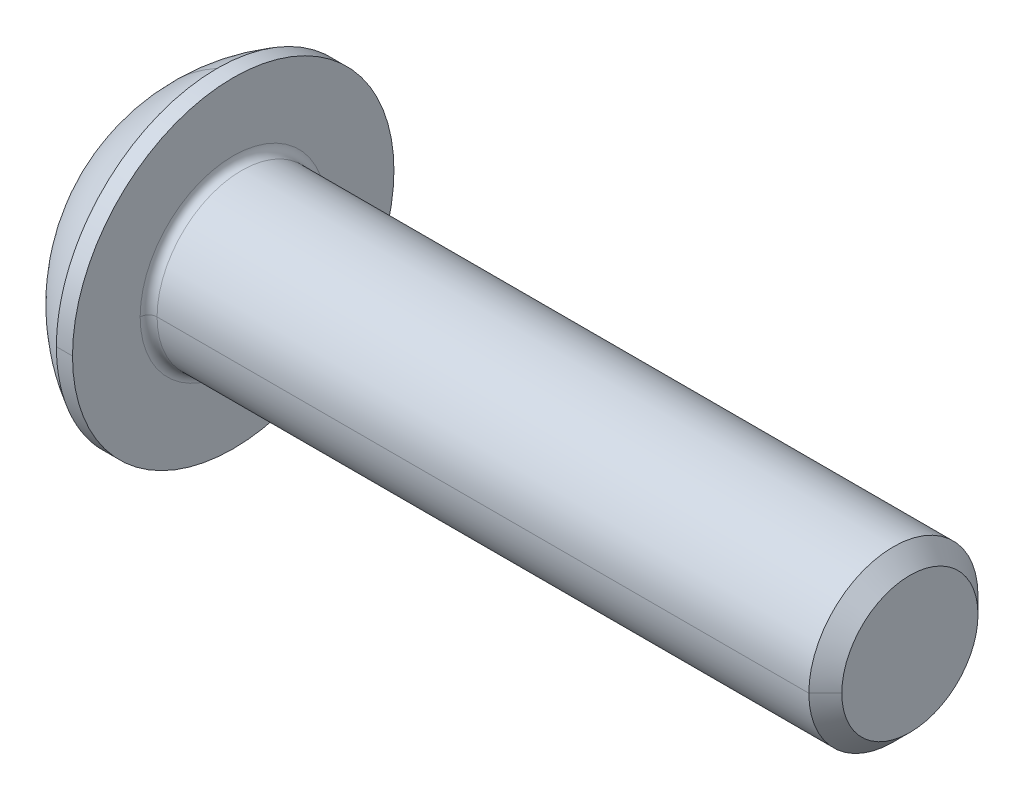
ISO-10303-21;
HEADER;
FILE_DESCRIPTION(('STEP AP214'),'2;1');
FILE_NAME('part.step','',(''),(''),'','','');
FILE_SCHEMA(('AUTOMOTIVE_DESIGN { 1 0 10303 214 1 1 1 1 }'));
ENDSEC;
DATA;
#1=APPLICATION_CONTEXT('core data for automotive mechanical design processes');
#2=APPLICATION_PROTOCOL_DEFINITION('international standard','automotive_design',2000,#1);
#3=PRODUCT_CONTEXT('',#1,'mechanical');
#4=PRODUCT('Part','Part','',(#3));
#5=PRODUCT_RELATED_PRODUCT_CATEGORY('part','',(#4));
#6=PRODUCT_DEFINITION_FORMATION('','',#4);
#7=PRODUCT_DEFINITION_CONTEXT('part definition',#1,'design');
#8=PRODUCT_DEFINITION('design','',#6,#7);
#9=PRODUCT_DEFINITION_SHAPE('','',#8);
#10=(LENGTH_UNIT() NAMED_UNIT(*) SI_UNIT(.MILLI.,.METRE.));
#11=(NAMED_UNIT(*) PLANE_ANGLE_UNIT() SI_UNIT($,.RADIAN.));
#12=(NAMED_UNIT(*) SI_UNIT($,.STERADIAN.) SOLID_ANGLE_UNIT());
#13=UNCERTAINTY_MEASURE_WITH_UNIT(LENGTH_MEASURE(1.E-05),#10,'distance_accuracy_value','');
#14=(GEOMETRIC_REPRESENTATION_CONTEXT(3) GLOBAL_UNCERTAINTY_ASSIGNED_CONTEXT((#13)) GLOBAL_UNIT_ASSIGNED_CONTEXT((#10,
#11,#12)) REPRESENTATION_CONTEXT('',''));
#15=CARTESIAN_POINT('',(0.,0.,0.));
#16=DIRECTION('',(0.,0.,1.));
#17=DIRECTION('',(1.,0.,0.));
#18=AXIS2_PLACEMENT_3D('',#15,#16,#17);
#19=CARTESIAN_POINT('',(-997.978312163513,0.,0.));
#20=DIRECTION('',(-1.,0.,0.));
#21=DIRECTION('',(0.,0.,1.));
#22=AXIS2_PLACEMENT_3D('',#19,#20,#21);
#23=CONICAL_SURFACE('',#22,1732.05080756885,1.0471975511966);
#24=DIRECTION('',(-0.5,0.,-0.866025403784436));
#25=VECTOR('',#24,1.);
#26=CARTESIAN_POINT('',(2.02168783648704,0.,0.));
#27=LINE('',#26,#25);
#28=CARTESIAN_POINT('',(2.02168783648704,0.,0.));
#29=VERTEX_POINT('',#28);
#30=CARTESIAN_POINT('',(1.3,0.,-1.25));
#31=VERTEX_POINT('',#30);
#32=EDGE_CURVE('E180',#29,#31,#27,.T.);
#33=ORIENTED_EDGE('',*,*,#32,.F.);
#34=DIRECTION('',(-0.5,0.,0.866025403784436));
#35=VECTOR('',#34,1.);
#36=CARTESIAN_POINT('',(2.02168783648704,0.,0.));
#37=LINE('',#36,#35);
#38=CARTESIAN_POINT('',(1.3,0.,1.25));
#39=VERTEX_POINT('',#38);
#40=EDGE_CURVE('E182',#29,#39,#37,.T.);
#41=ORIENTED_EDGE('',*,*,#40,.T.);
#42=CARTESIAN_POINT('',(1.3,0.,0.));
#43=DIRECTION('',(-1.,0.,0.));
#44=DIRECTION('',(0.,0.,1.));
#45=AXIS2_PLACEMENT_3D('',#42,#43,#44);
#46=CIRCLE('',#45,1.25);
#47=CARTESIAN_POINT('',(1.3,1.08253175473055,0.625));
#48=VERTEX_POINT('',#47);
#49=EDGE_CURVE('E11',#39,#48,#46,.T.);
#50=ORIENTED_EDGE('',*,*,#49,.T.);
#51=CARTESIAN_POINT('',(1.3,0.,0.));
#52=DIRECTION('',(-1.,0.,0.));
#53=DIRECTION('',(0.,0.,1.));
#54=AXIS2_PLACEMENT_3D('',#51,#52,#53);
#55=CIRCLE('',#54,1.25);
#56=CARTESIAN_POINT('',(1.3,1.08253175473055,-0.625));
#57=VERTEX_POINT('',#56);
#58=EDGE_CURVE('E25',#48,#57,#55,.T.);
#59=ORIENTED_EDGE('',*,*,#58,.T.);
#60=CARTESIAN_POINT('',(1.3,0.,0.));
#61=DIRECTION('',(-1.,0.,0.));
#62=DIRECTION('',(0.,0.,1.));
#63=AXIS2_PLACEMENT_3D('',#60,#61,#62);
#64=CIRCLE('',#63,1.25);
#65=EDGE_CURVE('E184',#57,#31,#64,.T.);
#66=ORIENTED_EDGE('',*,*,#65,.T.);
#67=EDGE_LOOP('',(#33,#41,#50,#59,#66));
#68=FACE_BOUND('',#67,.T.);
#69=ADVANCED_FACE('F16',(#68),#23,.F.);
#70=CARTESIAN_POINT('',(1.3,-1.44337567297406,0.));
#71=DIRECTION('',(1.,0.,0.));
#72=DIRECTION('',(0.,1.,0.));
#73=AXIS2_PLACEMENT_3D('',#70,#71,#72);
#74=PLANE('',#73);
#75=CARTESIAN_POINT('',(1.3,0.,0.));
#76=DIRECTION('',(-1.,0.,0.));
#77=DIRECTION('',(0.,0.,1.));
#78=AXIS2_PLACEMENT_3D('',#75,#76,#77);
#79=CIRCLE('',#78,1.25);
#80=CARTESIAN_POINT('',(1.3,-1.08253175473055,-0.625));
#81=VERTEX_POINT('',#80);
#82=EDGE_CURVE('E189',#31,#81,#79,.T.);
#83=ORIENTED_EDGE('',*,*,#82,.F.);
#84=DIRECTION('',(0.,1.,0.));
#85=VECTOR('',#84,1.);
#86=CARTESIAN_POINT('',(1.3,0.721687836487033,-1.25));
#87=LINE('',#86,#85);
#88=CARTESIAN_POINT('',(1.3,-0.721687836487032,-1.25));
#89=VERTEX_POINT('',#88);
#90=EDGE_CURVE('E362',#89,#31,#87,.T.);
#91=ORIENTED_EDGE('',*,*,#90,.F.);
#92=DIRECTION('',(0.,0.5,-0.866025403784439));
#93=VECTOR('',#92,1.);
#94=CARTESIAN_POINT('',(1.3,-0.721687836487032,-1.25));
#95=LINE('',#94,#93);
#96=EDGE_CURVE('E352',#81,#89,#95,.T.);
#97=ORIENTED_EDGE('',*,*,#96,.F.);
#98=EDGE_LOOP('',(#83,#91,#97));
#99=FACE_BOUND('',#98,.T.);
#100=ADVANCED_FACE('F18',(#99),#74,.F.);
#101=CARTESIAN_POINT('',(1.3,-1.44337567297406,0.));
#102=DIRECTION('',(1.,0.,0.));
#103=DIRECTION('',(0.,1.,0.));
#104=AXIS2_PLACEMENT_3D('',#101,#102,#103);
#105=PLANE('',#104);
#106=CARTESIAN_POINT('',(1.3,0.,0.));
#107=DIRECTION('',(-1.,0.,0.));
#108=DIRECTION('',(0.,0.,1.));
#109=AXIS2_PLACEMENT_3D('',#106,#107,#108);
#110=CIRCLE('',#109,1.25);
#111=CARTESIAN_POINT('',(1.3,-1.08253175473055,0.625));
#112=VERTEX_POINT('',#111);
#113=EDGE_CURVE('E225',#81,#112,#110,.T.);
#114=ORIENTED_EDGE('',*,*,#113,.F.);
#115=DIRECTION('',(0.,0.5,-0.866025403784439));
#116=VECTOR('',#115,1.);
#117=CARTESIAN_POINT('',(1.3,-0.721687836487032,-1.25));
#118=LINE('',#117,#116);
#119=CARTESIAN_POINT('',(1.3,-1.44337567297406,0.));
#120=VERTEX_POINT('',#119);
#121=EDGE_CURVE('E351',#120,#81,#118,.T.);
#122=ORIENTED_EDGE('',*,*,#121,.F.);
#123=DIRECTION('',(0.,-0.5,-0.866025403784439));
#124=VECTOR('',#123,1.);
#125=CARTESIAN_POINT('',(1.3,-1.44337567297406,0.));
#126=LINE('',#125,#124);
#127=EDGE_CURVE('E299',#112,#120,#126,.T.);
#128=ORIENTED_EDGE('',*,*,#127,.F.);
#129=EDGE_LOOP('',(#114,#122,#128));
#130=FACE_BOUND('',#129,.T.);
#131=ADVANCED_FACE('F896',(#130),#105,.F.);
#132=CARTESIAN_POINT('',(1.3,-1.44337567297406,0.));
#133=DIRECTION('',(1.,0.,0.));
#134=DIRECTION('',(0.,1.,0.));
#135=AXIS2_PLACEMENT_3D('',#132,#133,#134);
#136=PLANE('',#135);
#137=CARTESIAN_POINT('',(1.3,0.,0.));
#138=DIRECTION('',(-1.,0.,0.));
#139=DIRECTION('',(0.,0.,1.));
#140=AXIS2_PLACEMENT_3D('',#137,#138,#139);
#141=CIRCLE('',#140,1.25);
#142=EDGE_CURVE('E195',#112,#39,#141,.T.);
#143=ORIENTED_EDGE('',*,*,#142,.F.);
#144=DIRECTION('',(0.,-0.5,-0.866025403784439));
#145=VECTOR('',#144,1.);
#146=CARTESIAN_POINT('',(1.3,-1.44337567297406,0.));
#147=LINE('',#146,#145);
#148=CARTESIAN_POINT('',(1.3,-0.721687836487032,1.25));
#149=VERTEX_POINT('',#148);
#150=EDGE_CURVE('E295',#149,#112,#147,.T.);
#151=ORIENTED_EDGE('',*,*,#150,.F.);
#152=DIRECTION('',(0.,-1.,0.));
#153=VECTOR('',#152,1.);
#154=CARTESIAN_POINT('',(1.3,-0.721687836487032,1.25));
#155=LINE('',#154,#153);
#156=EDGE_CURVE('E383',#39,#149,#155,.T.);
#157=ORIENTED_EDGE('',*,*,#156,.F.);
#158=EDGE_LOOP('',(#143,#151,#157));
#159=FACE_BOUND('',#158,.T.);
#160=ADVANCED_FACE('F888',(#159),#136,.F.);
#161=CARTESIAN_POINT('',(1.3,-1.44337567297406,0.));
#162=DIRECTION('',(1.,0.,0.));
#163=DIRECTION('',(0.,1.,0.));
#164=AXIS2_PLACEMENT_3D('',#161,#162,#163);
#165=PLANE('',#164);
#166=ORIENTED_EDGE('',*,*,#49,.F.);
#167=DIRECTION('',(0.,-1.,0.));
#168=VECTOR('',#167,1.);
#169=CARTESIAN_POINT('',(1.3,-0.721687836487032,1.25));
#170=LINE('',#169,#168);
#171=CARTESIAN_POINT('',(1.3,0.721687836487033,1.25));
#172=VERTEX_POINT('',#171);
#173=EDGE_CURVE('E38',#172,#39,#170,.T.);
#174=ORIENTED_EDGE('',*,*,#173,.F.);
#175=DIRECTION('',(0.,-0.5,0.866025403784439));
#176=VECTOR('',#175,1.);
#177=CARTESIAN_POINT('',(1.3,0.721687836487033,1.25));
#178=LINE('',#177,#176);
#179=EDGE_CURVE('E246',#48,#172,#178,.T.);
#180=ORIENTED_EDGE('',*,*,#179,.F.);
#181=EDGE_LOOP('',(#166,#174,#180));
#182=FACE_BOUND('',#181,.T.);
#183=ADVANCED_FACE('F828',(#182),#165,.F.);
#184=CARTESIAN_POINT('',(1.3,-1.44337567297406,0.));
#185=DIRECTION('',(1.,0.,0.));
#186=DIRECTION('',(0.,1.,0.));
#187=AXIS2_PLACEMENT_3D('',#184,#185,#186);
#188=PLANE('',#187);
#189=ORIENTED_EDGE('',*,*,#58,.F.);
#190=DIRECTION('',(0.,-0.5,0.866025403784439));
#191=VECTOR('',#190,1.);
#192=CARTESIAN_POINT('',(1.3,0.721687836487033,1.25));
#193=LINE('',#192,#191);
#194=CARTESIAN_POINT('',(1.3,1.44337567297406,0.));
#195=VERTEX_POINT('',#194);
#196=EDGE_CURVE('E251',#195,#48,#193,.T.);
#197=ORIENTED_EDGE('',*,*,#196,.F.);
#198=DIRECTION('',(0.,0.5,0.866025403784439));
#199=VECTOR('',#198,1.);
#200=CARTESIAN_POINT('',(1.3,1.44337567297406,0.));
#201=LINE('',#200,#199);
#202=EDGE_CURVE('E269',#57,#195,#201,.T.);
#203=ORIENTED_EDGE('',*,*,#202,.F.);
#204=EDGE_LOOP('',(#189,#197,#203));
#205=FACE_BOUND('',#204,.T.);
#206=ADVANCED_FACE('F823',(#205),#188,.F.);
#207=CARTESIAN_POINT('',(1.3,-1.44337567297406,0.));
#208=DIRECTION('',(1.,0.,0.));
#209=DIRECTION('',(0.,1.,0.));
#210=AXIS2_PLACEMENT_3D('',#207,#208,#209);
#211=PLANE('',#210);
#212=ORIENTED_EDGE('',*,*,#65,.F.);
#213=DIRECTION('',(0.,0.5,0.866025403784439));
#214=VECTOR('',#213,1.);
#215=CARTESIAN_POINT('',(1.3,1.44337567297406,0.));
#216=LINE('',#215,#214);
#217=CARTESIAN_POINT('',(1.3,0.721687836487033,-1.25));
#218=VERTEX_POINT('',#217);
#219=EDGE_CURVE('E265',#218,#57,#216,.T.);
#220=ORIENTED_EDGE('',*,*,#219,.F.);
#221=DIRECTION('',(0.,1.,0.));
#222=VECTOR('',#221,1.);
#223=CARTESIAN_POINT('',(1.3,0.721687836487033,-1.25));
#224=LINE('',#223,#222);
#225=EDGE_CURVE('E366',#31,#218,#224,.T.);
#226=ORIENTED_EDGE('',*,*,#225,.F.);
#227=EDGE_LOOP('',(#212,#220,#226));
#228=FACE_BOUND('',#227,.T.);
#229=ADVANCED_FACE('F827',(#228),#211,.F.);
#230=CARTESIAN_POINT('',(1.3,-0.721687836487032,1.25));
#231=DIRECTION('',(0.,0.,-1.));
#232=DIRECTION('',(0.,-1.,0.));
#233=AXIS2_PLACEMENT_3D('',#230,#231,#232);
#234=PLANE('',#233);
#235=ORIENTED_EDGE('',*,*,#173,.T.);
#236=ORIENTED_EDGE('',*,*,#156,.T.);
#237=DIRECTION('',(-1.,0.,0.));
#238=VECTOR('',#237,1.);
#239=CARTESIAN_POINT('',(1.3,-0.721687836487032,1.25));
#240=LINE('',#239,#238);
#241=CARTESIAN_POINT('',(0.,-0.721687836487032,1.25));
#242=VERTEX_POINT('',#241);
#243=EDGE_CURVE('E348',#149,#242,#240,.T.);
#244=ORIENTED_EDGE('',*,*,#243,.T.);
#245=DIRECTION('',(0.,-1.,0.));
#246=VECTOR('',#245,1.);
#247=CARTESIAN_POINT('',(0.,-0.721687836487032,1.25));
#248=LINE('',#247,#246);
#249=CARTESIAN_POINT('',(0.,0.721687836487033,1.25));
#250=VERTEX_POINT('',#249);
#251=EDGE_CURVE('E313',#250,#242,#248,.T.);
#252=ORIENTED_EDGE('',*,*,#251,.F.);
#253=DIRECTION('',(-1.,0.,0.));
#254=VECTOR('',#253,1.);
#255=CARTESIAN_POINT('',(1.3,0.721687836487033,1.25));
#256=LINE('',#255,#254);
#257=EDGE_CURVE('E250',#172,#250,#256,.T.);
#258=ORIENTED_EDGE('',*,*,#257,.F.);
#259=EDGE_LOOP('',(#235,#236,#244,#252,#258));
#260=FACE_BOUND('',#259,.T.);
#261=ADVANCED_FACE('F863',(#260),#234,.T.);
#262=CARTESIAN_POINT('',(1.3,0.721687836487033,1.25));
#263=DIRECTION('',(0.,-0.866025403784439,-0.5));
#264=DIRECTION('',(0.,0.5,-0.866025403784439));
#265=AXIS2_PLACEMENT_3D('',#262,#263,#264);
#266=PLANE('',#265);
#267=ORIENTED_EDGE('',*,*,#196,.T.);
#268=ORIENTED_EDGE('',*,*,#179,.T.);
#269=ORIENTED_EDGE('',*,*,#257,.T.);
#270=DIRECTION('',(0.,-0.5,0.866025403784439));
#271=VECTOR('',#270,1.);
#272=CARTESIAN_POINT('',(0.,0.721687836487033,1.25));
#273=LINE('',#272,#271);
#274=CARTESIAN_POINT('',(0.,1.44337567297406,0.));
#275=VERTEX_POINT('',#274);
#276=EDGE_CURVE('E215',#275,#250,#273,.T.);
#277=ORIENTED_EDGE('',*,*,#276,.F.);
#278=DIRECTION('',(-1.,0.,0.));
#279=VECTOR('',#278,1.);
#280=CARTESIAN_POINT('',(1.3,1.44337567297406,0.));
#281=LINE('',#280,#279);
#282=EDGE_CURVE('E370',#195,#275,#281,.T.);
#283=ORIENTED_EDGE('',*,*,#282,.F.);
#284=EDGE_LOOP('',(#267,#268,#269,#277,#283));
#285=FACE_BOUND('',#284,.T.);
#286=ADVANCED_FACE('F854',(#285),#266,.T.);
#287=CARTESIAN_POINT('',(1.3,1.44337567297406,0.));
#288=DIRECTION('',(0.,-0.866025403784439,0.5));
#289=DIRECTION('',(-1.,0.,0.));
#290=AXIS2_PLACEMENT_3D('',#287,#288,#289);
#291=PLANE('',#290);
#292=ORIENTED_EDGE('',*,*,#219,.T.);
#293=ORIENTED_EDGE('',*,*,#202,.T.);
#294=ORIENTED_EDGE('',*,*,#282,.T.);
#295=DIRECTION('',(0.,0.5,0.866025403784439));
#296=VECTOR('',#295,1.);
#297=CARTESIAN_POINT('',(0.,1.44337567297406,0.));
#298=LINE('',#297,#296);
#299=CARTESIAN_POINT('',(0.,0.721687836487033,-1.25));
#300=VERTEX_POINT('',#299);
#301=EDGE_CURVE('E211',#300,#275,#298,.T.);
#302=ORIENTED_EDGE('',*,*,#301,.F.);
#303=DIRECTION('',(-1.,0.,0.));
#304=VECTOR('',#303,1.);
#305=CARTESIAN_POINT('',(1.3,0.721687836487033,-1.25));
#306=LINE('',#305,#304);
#307=EDGE_CURVE('E270',#218,#300,#306,.T.);
#308=ORIENTED_EDGE('',*,*,#307,.F.);
#309=EDGE_LOOP('',(#292,#293,#294,#302,#308));
#310=FACE_BOUND('',#309,.T.);
#311=ADVANCED_FACE('F845',(#310),#291,.T.);
#312=CARTESIAN_POINT('',(1.3,0.721687836487033,-1.25));
#313=DIRECTION('',(0.,0.,1.));
#314=DIRECTION('',(1.,0.,0.));
#315=AXIS2_PLACEMENT_3D('',#312,#313,#314);
#316=PLANE('',#315);
#317=ORIENTED_EDGE('',*,*,#90,.T.);
#318=ORIENTED_EDGE('',*,*,#225,.T.);
#319=ORIENTED_EDGE('',*,*,#307,.T.);
#320=DIRECTION('',(0.,1.,0.));
#321=VECTOR('',#320,1.);
#322=CARTESIAN_POINT('',(0.,0.721687836487033,-1.25));
#323=LINE('',#322,#321);
#324=CARTESIAN_POINT('',(0.,-0.721687836487032,-1.25));
#325=VERTEX_POINT('',#324);
#326=EDGE_CURVE('E216',#325,#300,#323,.T.);
#327=ORIENTED_EDGE('',*,*,#326,.F.);
#328=DIRECTION('',(-1.,0.,0.));
#329=VECTOR('',#328,1.);
#330=CARTESIAN_POINT('',(1.3,-0.721687836487032,-1.25));
#331=LINE('',#330,#329);
#332=EDGE_CURVE('E356',#89,#325,#331,.T.);
#333=ORIENTED_EDGE('',*,*,#332,.F.);
#334=EDGE_LOOP('',(#317,#318,#319,#327,#333));
#335=FACE_BOUND('',#334,.T.);
#336=ADVANCED_FACE('F714',(#335),#316,.T.);
#337=CARTESIAN_POINT('',(1.3,-0.721687836487032,-1.25));
#338=DIRECTION('',(0.,0.866025403784439,0.5));
#339=DIRECTION('',(1.,0.,0.));
#340=AXIS2_PLACEMENT_3D('',#337,#338,#339);
#341=PLANE('',#340);
#342=ORIENTED_EDGE('',*,*,#121,.T.);
#343=ORIENTED_EDGE('',*,*,#96,.T.);
#344=ORIENTED_EDGE('',*,*,#332,.T.);
#345=DIRECTION('',(0.,0.5,-0.866025403784439));
#346=VECTOR('',#345,1.);
#347=CARTESIAN_POINT('',(0.,-0.721687836487032,-1.25));
#348=LINE('',#347,#346);
#349=CARTESIAN_POINT('',(0.,-1.44337567297406,0.));
#350=VERTEX_POINT('',#349);
#351=EDGE_CURVE('E323',#350,#325,#348,.T.);
#352=ORIENTED_EDGE('',*,*,#351,.F.);
#353=DIRECTION('',(-1.,0.,0.));
#354=VECTOR('',#353,1.);
#355=CARTESIAN_POINT('',(1.3,-1.44337567297406,0.));
#356=LINE('',#355,#354);
#357=EDGE_CURVE('E345',#120,#350,#356,.T.);
#358=ORIENTED_EDGE('',*,*,#357,.F.);
#359=EDGE_LOOP('',(#342,#343,#344,#352,#358));
#360=FACE_BOUND('',#359,.T.);
#361=ADVANCED_FACE('F709',(#360),#341,.T.);
#362=CARTESIAN_POINT('',(1.3,-1.44337567297406,0.));
#363=DIRECTION('',(0.,0.866025403784439,-0.5));
#364=DIRECTION('',(-1.,0.,0.));
#365=AXIS2_PLACEMENT_3D('',#362,#363,#364);
#366=PLANE('',#365);
#367=ORIENTED_EDGE('',*,*,#150,.T.);
#368=ORIENTED_EDGE('',*,*,#127,.T.);
#369=ORIENTED_EDGE('',*,*,#357,.T.);
#370=DIRECTION('',(0.,-0.5,-0.866025403784439));
#371=VECTOR('',#370,1.);
#372=CARTESIAN_POINT('',(0.,-1.44337567297406,0.));
#373=LINE('',#372,#371);
#374=EDGE_CURVE('E317',#242,#350,#373,.T.);
#375=ORIENTED_EDGE('',*,*,#374,.F.);
#376=ORIENTED_EDGE('',*,*,#243,.F.);
#377=EDGE_LOOP('',(#367,#368,#369,#375,#376));
#378=FACE_BOUND('',#377,.T.);
#379=ADVANCED_FACE('F713',(#378),#366,.T.);
#380=CARTESIAN_POINT('',(2.4,0.,0.));
#381=DIRECTION('',(-1.,0.,0.));
#382=DIRECTION('',(0.,0.,1.));
#383=AXIS2_PLACEMENT_3D('',#380,#381,#382);
#384=TOROIDAL_SURFACE('',#383,2.2,0.2);
#385=CARTESIAN_POINT('',(2.4,0.,-2.2));
#386=DIRECTION('',(0.,1.,0.));
#387=DIRECTION('',(0.,0.,1.));
#388=AXIS2_PLACEMENT_3D('',#385,#386,#387);
#389=CIRCLE('',#388,0.2);
#390=CARTESIAN_POINT('',(2.2,0.,-2.2));
#391=VERTEX_POINT('',#390);
#392=CARTESIAN_POINT('',(2.4,0.,-2.));
#393=VERTEX_POINT('',#392);
#394=EDGE_CURVE('E234',#391,#393,#389,.T.);
#395=ORIENTED_EDGE('',*,*,#394,.F.);
#396=CARTESIAN_POINT('',(2.2,0.,0.));
#397=DIRECTION('',(-1.,0.,0.));
#398=DIRECTION('',(0.,0.,1.));
#399=AXIS2_PLACEMENT_3D('',#396,#397,#398);
#400=CIRCLE('',#399,2.2);
#401=CARTESIAN_POINT('',(2.2,0.,2.2));
#402=VERTEX_POINT('',#401);
#403=EDGE_CURVE('E238',#402,#391,#400,.T.);
#404=ORIENTED_EDGE('',*,*,#403,.F.);
#405=CARTESIAN_POINT('',(2.4,0.,2.2));
#406=DIRECTION('',(0.,-1.,0.));
#407=DIRECTION('',(0.,0.,-1.));
#408=AXIS2_PLACEMENT_3D('',#405,#406,#407);
#409=CIRCLE('',#408,0.2);
#410=CARTESIAN_POINT('',(2.4,0.,2.));
#411=VERTEX_POINT('',#410);
#412=EDGE_CURVE('E217',#402,#411,#409,.T.);
#413=ORIENTED_EDGE('',*,*,#412,.T.);
#414=CARTESIAN_POINT('',(2.4,0.,0.));
#415=DIRECTION('',(1.,0.,0.));
#416=DIRECTION('',(0.,0.,1.));
#417=AXIS2_PLACEMENT_3D('',#414,#415,#416);
#418=CIRCLE('',#417,2.);
#419=EDGE_CURVE('E209',#393,#411,#418,.T.);
#420=ORIENTED_EDGE('',*,*,#419,.F.);
#421=EDGE_LOOP('',(#395,#404,#413,#420));
#422=FACE_BOUND('',#421,.T.);
#423=ADVANCED_FACE('F793',(#422),#384,.F.);
#424=CARTESIAN_POINT('',(18.2,0.,0.));
#425=DIRECTION('',(-1.,0.,0.));
#426=DIRECTION('',(0.,0.,1.));
#427=AXIS2_PLACEMENT_3D('',#424,#425,#426);
#428=PLANE('',#427);
#429=CARTESIAN_POINT('',(18.2,0.,0.));
#430=DIRECTION('',(-1.,0.,0.));
#431=DIRECTION('',(0.,0.,1.));
#432=AXIS2_PLACEMENT_3D('',#429,#430,#431);
#433=CIRCLE('',#432,1.61);
#434=CARTESIAN_POINT('',(18.2,0.,1.61));
#435=VERTEX_POINT('',#434);
#436=CARTESIAN_POINT('',(18.2,0.,-1.61));
#437=VERTEX_POINT('',#436);
#438=EDGE_CURVE('E220',#435,#437,#433,.T.);
#439=ORIENTED_EDGE('',*,*,#438,.F.);
#440=CARTESIAN_POINT('',(18.2,0.,0.));
#441=DIRECTION('',(-1.,0.,0.));
#442=DIRECTION('',(0.,0.,1.));
#443=AXIS2_PLACEMENT_3D('',#440,#441,#442);
#444=CIRCLE('',#443,1.61);
#445=EDGE_CURVE('E300',#437,#435,#444,.T.);
#446=ORIENTED_EDGE('',*,*,#445,.F.);
#447=EDGE_LOOP('',(#439,#446));
#448=FACE_BOUND('',#447,.T.);
#449=ADVANCED_FACE('F723',(#448),#428,.F.);
#450=CARTESIAN_POINT('',(18.2,0.,0.));
#451=DIRECTION('',(-1.,0.,0.));
#452=DIRECTION('',(0.,0.,1.));
#453=AXIS2_PLACEMENT_3D('',#450,#451,#452);
#454=CONICAL_SURFACE('',#453,1.61,0.785398163397447);
#455=DIRECTION('',(-0.707106781186549,0.,-0.707106781186547));
#456=VECTOR('',#455,1.);
#457=CARTESIAN_POINT('',(18.2,0.,-1.61));
#458=LINE('',#457,#456);
#459=CARTESIAN_POINT('',(17.81,0.,-2.));
#460=VERTEX_POINT('',#459);
#461=EDGE_CURVE('E255',#437,#460,#458,.T.);
#462=ORIENTED_EDGE('',*,*,#461,.F.);
#463=ORIENTED_EDGE('',*,*,#445,.T.);
#464=DIRECTION('',(-0.707106781186549,0.,0.707106781186547));
#465=VECTOR('',#464,1.);
#466=CARTESIAN_POINT('',(18.2,0.,1.61));
#467=LINE('',#466,#465);
#468=CARTESIAN_POINT('',(17.81,0.,2.));
#469=VERTEX_POINT('',#468);
#470=EDGE_CURVE('E210',#435,#469,#467,.T.);
#471=ORIENTED_EDGE('',*,*,#470,.T.);
#472=CARTESIAN_POINT('',(17.81,0.,0.));
#473=DIRECTION('',(-1.,0.,0.));
#474=DIRECTION('',(0.,0.,1.));
#475=AXIS2_PLACEMENT_3D('',#472,#473,#474);
#476=CIRCLE('',#475,2.);
#477=EDGE_CURVE('E337',#460,#469,#476,.T.);
#478=ORIENTED_EDGE('',*,*,#477,.F.);
#479=EDGE_LOOP('',(#462,#463,#471,#478));
#480=FACE_BOUND('',#479,.T.);
#481=ADVANCED_FACE('F686',(#480),#454,.T.);
#482=CARTESIAN_POINT('',(0.,0.,0.));
#483=DIRECTION('',(-1.,0.,0.));
#484=DIRECTION('',(0.,0.,1.));
#485=AXIS2_PLACEMENT_3D('',#482,#483,#484);
#486=CYLINDRICAL_SURFACE('',#485,2.);
#487=DIRECTION('',(-1.,0.,0.));
#488=VECTOR('',#487,1.);
#489=CARTESIAN_POINT('',(0.,0.,-2.));
#490=LINE('',#489,#488);
#491=EDGE_CURVE('E205',#460,#393,#490,.T.);
#492=ORIENTED_EDGE('',*,*,#491,.F.);
#493=ORIENTED_EDGE('',*,*,#477,.T.);
#494=DIRECTION('',(-1.,0.,0.));
#495=VECTOR('',#494,1.);
#496=CARTESIAN_POINT('',(0.,0.,2.));
#497=LINE('',#496,#495);
#498=EDGE_CURVE('E203',#469,#411,#497,.T.);
#499=ORIENTED_EDGE('',*,*,#498,.T.);
#500=CARTESIAN_POINT('',(2.4,0.,0.));
#501=DIRECTION('',(1.,0.,0.));
#502=DIRECTION('',(0.,0.,1.));
#503=AXIS2_PLACEMENT_3D('',#500,#501,#502);
#504=CIRCLE('',#503,2.);
#505=EDGE_CURVE('E221',#411,#393,#504,.T.);
#506=ORIENTED_EDGE('',*,*,#505,.T.);
#507=EDGE_LOOP('',(#492,#493,#499,#506));
#508=FACE_BOUND('',#507,.T.);
#509=ADVANCED_FACE('F681',(#508),#486,.T.);
#510=CARTESIAN_POINT('',(2.2,2.,0.));
#511=DIRECTION('',(-1.,0.,0.));
#512=DIRECTION('',(0.,0.,1.));
#513=AXIS2_PLACEMENT_3D('',#510,#511,#512);
#514=PLANE('',#513);
#515=ORIENTED_EDGE('',*,*,#403,.T.);
#516=CARTESIAN_POINT('',(2.2,0.,0.));
#517=DIRECTION('',(-1.,0.,0.));
#518=DIRECTION('',(0.,0.,1.));
#519=AXIS2_PLACEMENT_3D('',#516,#517,#518);
#520=CIRCLE('',#519,2.2);
#521=EDGE_CURVE('E230',#391,#402,#520,.T.);
#522=ORIENTED_EDGE('',*,*,#521,.T.);
#523=EDGE_LOOP('',(#515,#522));
#524=FACE_BOUND('',#523,.T.);
#525=CARTESIAN_POINT('',(2.2,0.,0.));
#526=DIRECTION('',(-1.,0.,0.));
#527=DIRECTION('',(0.,0.,1.));
#528=AXIS2_PLACEMENT_3D('',#525,#526,#527);
#529=CIRCLE('',#528,3.8);
#530=CARTESIAN_POINT('',(2.2,0.,3.8));
#531=VERTEX_POINT('',#530);
#532=CARTESIAN_POINT('',(2.2,0.,-3.8));
#533=VERTEX_POINT('',#532);
#534=EDGE_CURVE('E261',#531,#533,#529,.T.);
#535=ORIENTED_EDGE('',*,*,#534,.F.);
#536=CARTESIAN_POINT('',(2.2,0.,0.));
#537=DIRECTION('',(-1.,0.,0.));
#538=DIRECTION('',(0.,0.,1.));
#539=AXIS2_PLACEMENT_3D('',#536,#537,#538);
#540=CIRCLE('',#539,3.8);
#541=EDGE_CURVE('E235',#533,#531,#540,.T.);
#542=ORIENTED_EDGE('',*,*,#541,.F.);
#543=EDGE_LOOP('',(#535,#542));
#544=FACE_BOUND('',#543,.T.);
#545=ADVANCED_FACE('F685',(#524,#544),#514,.F.);
#546=CARTESIAN_POINT('',(0.,0.,0.));
#547=DIRECTION('',(-1.,0.,0.));
#548=DIRECTION('',(0.,0.,1.));
#549=AXIS2_PLACEMENT_3D('',#546,#547,#548);
#550=CYLINDRICAL_SURFACE('',#549,3.8);
#551=DIRECTION('',(-1.,0.,0.));
#552=VECTOR('',#551,1.);
#553=CARTESIAN_POINT('',(0.,0.,-3.8));
#554=LINE('',#553,#552);
#555=CARTESIAN_POINT('',(1.82,0.,-3.8));
#556=VERTEX_POINT('',#555);
#557=EDGE_CURVE('E256',#533,#556,#554,.T.);
#558=ORIENTED_EDGE('',*,*,#557,.F.);
#559=ORIENTED_EDGE('',*,*,#541,.T.);
#560=DIRECTION('',(-1.,0.,0.));
#561=VECTOR('',#560,1.);
#562=CARTESIAN_POINT('',(0.,0.,3.8));
#563=LINE('',#562,#561);
#564=CARTESIAN_POINT('',(1.82,0.,3.8));
#565=VERTEX_POINT('',#564);
#566=EDGE_CURVE('E281',#531,#565,#563,.T.);
#567=ORIENTED_EDGE('',*,*,#566,.T.);
#568=CARTESIAN_POINT('',(1.82,0.,0.));
#569=DIRECTION('',(-1.,0.,0.));
#570=DIRECTION('',(0.,0.,1.));
#571=AXIS2_PLACEMENT_3D('',#568,#569,#570);
#572=CIRCLE('',#571,3.8);
#573=CARTESIAN_POINT('',(1.82,-3.8,0.));
#574=VERTEX_POINT('',#573);
#575=EDGE_CURVE('E239',#574,#565,#572,.T.);
#576=ORIENTED_EDGE('',*,*,#575,.F.);
#577=CARTESIAN_POINT('',(1.82,0.,0.));
#578=DIRECTION('',(-1.,0.,0.));
#579=DIRECTION('',(0.,0.,1.));
#580=AXIS2_PLACEMENT_3D('',#577,#578,#579);
#581=CIRCLE('',#580,3.8);
#582=EDGE_CURVE('E285',#556,#574,#581,.T.);
#583=ORIENTED_EDGE('',*,*,#582,.F.);
#584=EDGE_LOOP('',(#558,#559,#567,#576,#583));
#585=FACE_BOUND('',#584,.T.);
#586=ADVANCED_FACE('F736',(#585),#550,.T.);
#587=CARTESIAN_POINT('',(3.88527472527473,0.,0.));
#588=DIRECTION('',(0.,0.,-1.));
#589=DIRECTION('',(0.,1.,0.));
#590=AXIS2_PLACEMENT_3D('',#587,#588,#589);
#591=SPHERICAL_SURFACE('',#590,4.3249693283142);
#592=CARTESIAN_POINT('',(3.88527472527473,0.,0.));
#593=DIRECTION('',(0.,0.,-1.));
#594=DIRECTION('',(0.,1.,0.));
#595=AXIS2_PLACEMENT_3D('',#592,#593,#594);
#596=CIRCLE('',#595,4.3249693283142);
#597=CARTESIAN_POINT('',(0.,-1.9,0.));
#598=VERTEX_POINT('',#597);
#599=EDGE_CURVE('E290',#574,#598,#596,.T.);
#600=ORIENTED_EDGE('',*,*,#599,.F.);
#601=ORIENTED_EDGE('',*,*,#575,.T.);
#602=CARTESIAN_POINT('',(1.82,0.,0.));
#603=DIRECTION('',(-1.,0.,0.));
#604=DIRECTION('',(0.,0.,1.));
#605=AXIS2_PLACEMENT_3D('',#602,#603,#604);
#606=CIRCLE('',#605,3.8);
#607=CARTESIAN_POINT('',(1.82,3.8,0.));
#608=VERTEX_POINT('',#607);
#609=EDGE_CURVE('E286',#565,#608,#606,.T.);
#610=ORIENTED_EDGE('',*,*,#609,.T.);
#611=CARTESIAN_POINT('',(3.88527472527473,0.,0.));
#612=DIRECTION('',(0.,0.,1.));
#613=DIRECTION('',(1.,0.,0.));
#614=AXIS2_PLACEMENT_3D('',#611,#612,#613);
#615=CIRCLE('',#614,4.3249693283142);
#616=CARTESIAN_POINT('',(0.,1.9,0.));
#617=VERTEX_POINT('',#616);
#618=EDGE_CURVE('E304',#608,#617,#615,.T.);
#619=ORIENTED_EDGE('',*,*,#618,.T.);
#620=CARTESIAN_POINT('',(0.,0.,0.));
#621=DIRECTION('',(-1.,0.,0.));
#622=DIRECTION('',(0.,0.,1.));
#623=AXIS2_PLACEMENT_3D('',#620,#621,#622);
#624=CIRCLE('',#623,1.9);
#625=EDGE_CURVE('E310',#598,#617,#624,.T.);
#626=ORIENTED_EDGE('',*,*,#625,.F.);
#627=EDGE_LOOP('',(#600,#601,#610,#619,#626));
#628=FACE_BOUND('',#627,.T.);
#629=ADVANCED_FACE('F740',(#628),#591,.T.);
#630=CARTESIAN_POINT('',(0.,0.,0.));
#631=DIRECTION('',(-1.,0.,0.));
#632=DIRECTION('',(0.,0.,1.));
#633=AXIS2_PLACEMENT_3D('',#630,#631,#632);
#634=PLANE('',#633);
#635=ORIENTED_EDGE('',*,*,#251,.T.);
#636=ORIENTED_EDGE('',*,*,#374,.T.);
#637=ORIENTED_EDGE('',*,*,#351,.T.);
#638=ORIENTED_EDGE('',*,*,#326,.T.);
#639=ORIENTED_EDGE('',*,*,#301,.T.);
#640=ORIENTED_EDGE('',*,*,#276,.T.);
#641=EDGE_LOOP('',(#635,#636,#637,#638,#639,#640));
#642=FACE_BOUND('',#641,.T.);
#643=CARTESIAN_POINT('',(0.,0.,0.));
#644=DIRECTION('',(-1.,0.,0.));
#645=DIRECTION('',(0.,0.,1.));
#646=AXIS2_PLACEMENT_3D('',#643,#644,#645);
#647=CIRCLE('',#646,1.9);
#648=EDGE_CURVE('E294',#617,#598,#647,.T.);
#649=ORIENTED_EDGE('',*,*,#648,.T.);
#650=ORIENTED_EDGE('',*,*,#625,.T.);
#651=EDGE_LOOP('',(#649,#650));
#652=FACE_BOUND('',#651,.T.);
#653=ADVANCED_FACE('F764',(#642,#652),#634,.T.);
#654=CARTESIAN_POINT('',(3.88527472527473,0.,0.));
#655=DIRECTION('',(0.,0.,-1.));
#656=DIRECTION('',(0.,1.,0.));
#657=AXIS2_PLACEMENT_3D('',#654,#655,#656);
#658=SPHERICAL_SURFACE('',#657,4.3249693283142);
#659=CARTESIAN_POINT('',(1.82,0.,0.));
#660=DIRECTION('',(-1.,0.,0.));
#661=DIRECTION('',(0.,0.,1.));
#662=AXIS2_PLACEMENT_3D('',#659,#660,#661);
#663=CIRCLE('',#662,3.8);
#664=EDGE_CURVE('E260',#608,#556,#663,.T.);
#665=ORIENTED_EDGE('',*,*,#664,.T.);
#666=ORIENTED_EDGE('',*,*,#582,.T.);
#667=ORIENTED_EDGE('',*,*,#599,.T.);
#668=ORIENTED_EDGE('',*,*,#648,.F.);
#669=ORIENTED_EDGE('',*,*,#618,.F.);
#670=EDGE_LOOP('',(#665,#666,#667,#668,#669));
#671=FACE_BOUND('',#670,.T.);
#672=ADVANCED_FACE('F768',(#671),#658,.T.);
#673=CARTESIAN_POINT('',(0.,0.,0.));
#674=DIRECTION('',(-1.,0.,0.));
#675=DIRECTION('',(0.,0.,1.));
#676=AXIS2_PLACEMENT_3D('',#673,#674,#675);
#677=CYLINDRICAL_SURFACE('',#676,3.8);
#678=ORIENTED_EDGE('',*,*,#534,.T.);
#679=ORIENTED_EDGE('',*,*,#557,.T.);
#680=ORIENTED_EDGE('',*,*,#664,.F.);
#681=ORIENTED_EDGE('',*,*,#609,.F.);
#682=ORIENTED_EDGE('',*,*,#566,.F.);
#683=EDGE_LOOP('',(#678,#679,#680,#681,#682));
#684=FACE_BOUND('',#683,.T.);
#685=ADVANCED_FACE('F758',(#684),#677,.T.);
#686=CARTESIAN_POINT('',(0.,0.,0.));
#687=DIRECTION('',(-1.,0.,0.));
#688=DIRECTION('',(0.,0.,1.));
#689=AXIS2_PLACEMENT_3D('',#686,#687,#688);
#690=CYLINDRICAL_SURFACE('',#689,2.);
#691=CARTESIAN_POINT('',(17.81,0.,0.));
#692=DIRECTION('',(-1.,0.,0.));
#693=DIRECTION('',(0.,0.,1.));
#694=AXIS2_PLACEMENT_3D('',#691,#692,#693);
#695=CIRCLE('',#694,2.);
#696=EDGE_CURVE('E271',#469,#460,#695,.T.);
#697=ORIENTED_EDGE('',*,*,#696,.T.);
#698=ORIENTED_EDGE('',*,*,#491,.T.);
#699=ORIENTED_EDGE('',*,*,#419,.T.);
#700=ORIENTED_EDGE('',*,*,#498,.F.);
#701=EDGE_LOOP('',(#697,#698,#699,#700));
#702=FACE_BOUND('',#701,.T.);
#703=ADVANCED_FACE('F749',(#702),#690,.T.);
#704=CARTESIAN_POINT('',(18.2,0.,0.));
#705=DIRECTION('',(-1.,0.,0.));
#706=DIRECTION('',(0.,0.,1.));
#707=AXIS2_PLACEMENT_3D('',#704,#705,#706);
#708=CONICAL_SURFACE('',#707,1.61,0.785398163397447);
#709=ORIENTED_EDGE('',*,*,#438,.T.);
#710=ORIENTED_EDGE('',*,*,#461,.T.);
#711=ORIENTED_EDGE('',*,*,#696,.F.);
#712=ORIENTED_EDGE('',*,*,#470,.F.);
#713=EDGE_LOOP('',(#709,#710,#711,#712));
#714=FACE_BOUND('',#713,.T.);
#715=ADVANCED_FACE('F703',(#714),#708,.T.);
#716=CARTESIAN_POINT('',(2.4,0.,0.));
#717=DIRECTION('',(-1.,0.,0.));
#718=DIRECTION('',(0.,0.,1.));
#719=AXIS2_PLACEMENT_3D('',#716,#717,#718);
#720=TOROIDAL_SURFACE('',#719,2.2,0.2);
#721=ORIENTED_EDGE('',*,*,#521,.F.);
#722=ORIENTED_EDGE('',*,*,#394,.T.);
#723=ORIENTED_EDGE('',*,*,#505,.F.);
#724=ORIENTED_EDGE('',*,*,#412,.F.);
#725=EDGE_LOOP('',(#721,#722,#723,#724));
#726=FACE_BOUND('',#725,.T.);
#727=ADVANCED_FACE('F695',(#726),#720,.F.);
#728=CARTESIAN_POINT('',(-997.978312163513,0.,0.));
#729=DIRECTION('',(-1.,0.,0.));
#730=DIRECTION('',(0.,0.,1.));
#731=AXIS2_PLACEMENT_3D('',#728,#729,#730);
#732=CONICAL_SURFACE('',#731,1732.05080756885,1.0471975511966);
#733=ORIENTED_EDGE('',*,*,#40,.F.);
#734=ORIENTED_EDGE('',*,*,#32,.T.);
#735=ORIENTED_EDGE('',*,*,#82,.T.);
#736=ORIENTED_EDGE('',*,*,#113,.T.);
#737=ORIENTED_EDGE('',*,*,#142,.T.);
#738=EDGE_LOOP('',(#733,#734,#735,#736,#737));
#739=FACE_BOUND('',#738,.T.);
#740=ADVANCED_FACE('F192',(#739),#732,.F.);
#741=CLOSED_SHELL('',(#69,#100,#131,#160,#183,#206,#229,#261,#286,#311,#336,#361,#379,#423,#449,
#481,#509,#545,#586,#629,#653,#672,#685,#703,#715,#727,#740));
#742=MANIFOLD_SOLID_BREP('B1',#741);
#743=ADVANCED_BREP_SHAPE_REPRESENTATION('',(#18,#742),#14);
#744=SHAPE_DEFINITION_REPRESENTATION(#9,#743);
ENDSEC;
END-ISO-10303-21;
